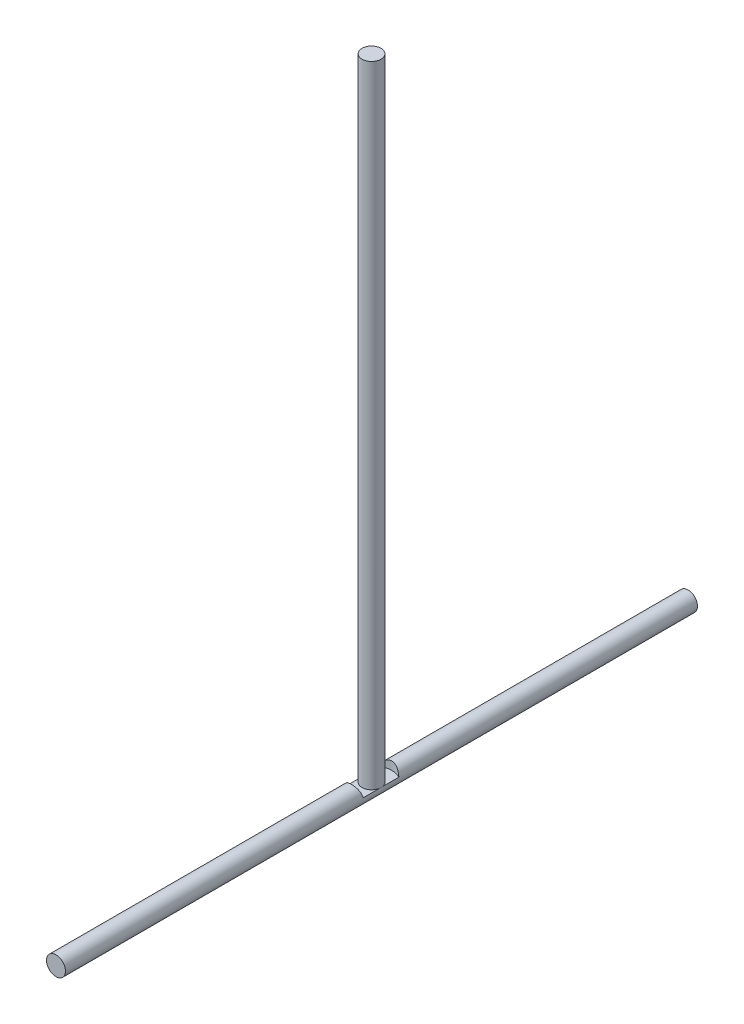
ISO-10303-21;
HEADER;
FILE_DESCRIPTION(('STEP AP214'),'2;1');
FILE_NAME('part.step','',(''),(''),'','','');
FILE_SCHEMA(('AUTOMOTIVE_DESIGN { 1 0 10303 214 1 1 1 1 }'));
ENDSEC;
DATA;
#1=APPLICATION_CONTEXT('core data for automotive mechanical design processes');
#2=APPLICATION_PROTOCOL_DEFINITION('international standard','automotive_design',2000,#1);
#3=PRODUCT_CONTEXT('',#1,'mechanical');
#4=PRODUCT('Part','Part','',(#3));
#5=PRODUCT_RELATED_PRODUCT_CATEGORY('part','',(#4));
#6=PRODUCT_DEFINITION_FORMATION('','',#4);
#7=PRODUCT_DEFINITION_CONTEXT('part definition',#1,'design');
#8=PRODUCT_DEFINITION('design','',#6,#7);
#9=PRODUCT_DEFINITION_SHAPE('','',#8);
#10=(LENGTH_UNIT() NAMED_UNIT(*) SI_UNIT(.MILLI.,.METRE.));
#11=(NAMED_UNIT(*) PLANE_ANGLE_UNIT() SI_UNIT($,.RADIAN.));
#12=(NAMED_UNIT(*) SI_UNIT($,.STERADIAN.) SOLID_ANGLE_UNIT());
#13=UNCERTAINTY_MEASURE_WITH_UNIT(LENGTH_MEASURE(1.E-05),#10,'distance_accuracy_value','');
#14=(GEOMETRIC_REPRESENTATION_CONTEXT(3) GLOBAL_UNCERTAINTY_ASSIGNED_CONTEXT((#13)) GLOBAL_UNIT_ASSIGNED_CONTEXT((#10,
#11,#12)) REPRESENTATION_CONTEXT('',''));
#15=CARTESIAN_POINT('',(0.,0.,0.));
#16=DIRECTION('',(0.,0.,1.));
#17=DIRECTION('',(1.,0.,0.));
#18=AXIS2_PLACEMENT_3D('',#15,#16,#17);
#19=CARTESIAN_POINT('',(0.,1.,250.362407271813));
#20=DIRECTION('',(0.,1.,0.));
#21=DIRECTION('',(0.,0.,1.));
#22=AXIS2_PLACEMENT_3D('',#19,#20,#21);
#23=PLANE('',#22);
#24=DIRECTION('',(0.,0.,-1.));
#25=VECTOR('',#24,1.);
#26=CARTESIAN_POINT('',(-7.43303437365925,1.,500.));
#27=LINE('',#26,#25);
#28=CARTESIAN_POINT('',(-7.43303437365925,1.,236.193779956508));
#29=VERTEX_POINT('',#28);
#30=CARTESIAN_POINT('',(-7.43303437365925,1.,249.362407271813));
#31=VERTEX_POINT('',#30);
#32=EDGE_CURVE('E115',#29,#31,#27,.F.);
#33=ORIENTED_EDGE('',*,*,#32,.T.);
#34=CARTESIAN_POINT('',(0.,1.,250.362407271813));
#35=DIRECTION('',(0.,1.,0.));
#36=DIRECTION('',(0.,0.,1.));
#37=AXIS2_PLACEMENT_3D('',#34,#35,#36);
#38=CIRCLE('',#37,7.5);
#39=CARTESIAN_POINT('',(7.43303437365925,1.,249.362407271813));
#40=VERTEX_POINT('',#39);
#41=EDGE_CURVE('E11',#31,#40,#38,.F.);
#42=ORIENTED_EDGE('',*,*,#41,.T.);
#43=DIRECTION('',(0.,0.,-1.));
#44=VECTOR('',#43,1.);
#45=CARTESIAN_POINT('',(7.43303437365925,1.,500.));
#46=LINE('',#45,#44);
#47=CARTESIAN_POINT('',(7.43303437365925,1.,236.193779956508));
#48=VERTEX_POINT('',#47);
#49=EDGE_CURVE('E102',#40,#48,#46,.T.);
#50=ORIENTED_EDGE('',*,*,#49,.T.);
#51=CARTESIAN_POINT('',(0.,1.,250.362407271813));
#52=DIRECTION('',(0.,1.,0.));
#53=DIRECTION('',(0.,0.,1.));
#54=AXIS2_PLACEMENT_3D('',#51,#52,#53);
#55=CIRCLE('',#54,16.);
#56=EDGE_CURVE('E64',#48,#29,#55,.T.);
#57=ORIENTED_EDGE('',*,*,#56,.T.);
#58=EDGE_LOOP('',(#33,#42,#50,#57));
#59=FACE_BOUND('',#58,.T.);
#60=ADVANCED_FACE('F39',(#59),#23,.T.);
#61=CARTESIAN_POINT('',(0.,0.,500.));
#62=DIRECTION('',(0.,0.,-1.));
#63=DIRECTION('',(-1.,0.,0.));
#64=AXIS2_PLACEMENT_3D('',#61,#62,#63);
#65=CYLINDRICAL_SURFACE('',#64,7.5);
#66=CARTESIAN_POINT('',(0.,0.,0.));
#67=DIRECTION('',(0.,0.,1.));
#68=DIRECTION('',(1.,0.,0.));
#69=AXIS2_PLACEMENT_3D('',#66,#67,#68);
#70=CIRCLE('',#69,7.5);
#71=CARTESIAN_POINT('',(7.5,0.,0.));
#72=VERTEX_POINT('',#71);
#73=EDGE_CURVE('E162',#72,#72,#70,.T.);
#74=ORIENTED_EDGE('',*,*,#73,.T.);
#75=EDGE_LOOP('',(#74));
#76=FACE_BOUND('',#75,.T.);
#77=CARTESIAN_POINT('',(0.,0.,500.));
#78=DIRECTION('',(0.,0.,1.));
#79=DIRECTION('',(1.,0.,0.));
#80=AXIS2_PLACEMENT_3D('',#77,#78,#79);
#81=CIRCLE('',#80,7.5);
#82=CARTESIAN_POINT('',(7.5,0.,500.));
#83=VERTEX_POINT('',#82);
#84=EDGE_CURVE('E171',#83,#83,#81,.T.);
#85=ORIENTED_EDGE('',*,*,#84,.F.);
#86=EDGE_LOOP('',(#85));
#87=FACE_BOUND('',#86,.T.);
#88=CARTESIAN_POINT('',(7.43303437365925,1.,264.531034587117));
#89=VERTEX_POINT('',#88);
#90=CARTESIAN_POINT('',(7.43303437365925,1.,251.362407271813));
#91=VERTEX_POINT('',#90);
#92=EDGE_CURVE('E89',#89,#91,#46,.T.);
#93=ORIENTED_EDGE('',*,*,#92,.F.);
#94=CARTESIAN_POINT('',(7.43303437365925,1.,264.531034587117));
#95=CARTESIAN_POINT('',(7.40559673448088,1.20417418058325,264.545398264692));
#96=CARTESIAN_POINT('',(7.36973608887161,1.40685261559802,264.564140044357));
#97=CARTESIAN_POINT('',(7.2817882143433,1.80762024865179,264.609450136758));
#98=CARTESIAN_POINT('',(7.22971259440707,2.00571262138113,264.636012849421));
#99=CARTESIAN_POINT('',(7.11017935329695,2.39513949711642,264.695924926851));
#100=CARTESIAN_POINT('',(7.04279107679191,2.58650010688598,264.729243625492));
#101=CARTESIAN_POINT('',(6.89318915584988,2.96223442949698,264.801619848646));
#102=CARTESIAN_POINT('',(6.81097309071827,3.14660699555653,264.840678310006));
#103=CARTESIAN_POINT('',(6.63268186261012,3.5068238309024,264.923215792449));
#104=CARTESIAN_POINT('',(6.53664520580528,3.68269003886055,264.966682435494));
#105=CARTESIAN_POINT('',(6.33121503063991,4.02562838614904,265.056906364696));
#106=CARTESIAN_POINT('',(6.22181689771652,4.1926974586012,265.103664785337));
#107=CARTESIAN_POINT('',(5.99023954778523,4.51739309350605,265.199278120021));
#108=CARTESIAN_POINT('',(5.86804580225103,4.67500859576214,265.248135379219));
#109=CARTESIAN_POINT('',(5.61164327741791,4.97987300032481,265.346676463291));
#110=CARTESIAN_POINT('',(5.47743389543021,5.12712138196753,265.396360329524));
#111=CARTESIAN_POINT('',(5.18747097803945,5.4208648526506,265.498968291706));
#112=CARTESIAN_POINT('',(5.03086034194655,5.56652499055838,265.551865010478));
#113=CARTESIAN_POINT('',(4.70546877551462,5.8441671585393,265.655795452156));
#114=CARTESIAN_POINT('',(4.53669189727199,5.97615370737801,265.706829786897));
#115=CARTESIAN_POINT('',(4.18778684133698,6.22562775054615,265.805700989929));
#116=CARTESIAN_POINT('',(4.00765606855613,6.34311191186982,265.85353712204));
#117=CARTESIAN_POINT('',(3.63719104045161,6.56255787678823,265.944679435119));
#118=CARTESIAN_POINT('',(3.44686157611634,6.66452688390385,265.987987715378));
#119=CARTESIAN_POINT('',(3.0581548935784,6.85156582493414,266.068675831004));
#120=CARTESIAN_POINT('',(2.85982623033871,6.93672333143343,266.106086172013));
#121=CARTESIAN_POINT('',(2.45553374241883,7.0899280280309,266.174186669028));
#122=CARTESIAN_POINT('',(2.24956986270232,7.15797509476575,266.204876776582));
#123=CARTESIAN_POINT('',(1.83170740602701,7.2761225865865,266.258607806546));
#124=CARTESIAN_POINT('',(1.61981241727731,7.32623362000128,266.281653249827));
#125=CARTESIAN_POINT('',(1.19175226759904,7.40791392999818,266.319407999242));
#126=CARTESIAN_POINT('',(0.975587518167709,7.43948498444149,266.334118104674));
#127=CARTESIAN_POINT('',(0.560187267692671,7.4817002365052,266.353827760953));
#128=CARTESIAN_POINT('',(0.361148649765772,7.49395067183162,266.359572169894));
#129=CARTESIAN_POINT('',(-0.037340981800173,7.50255387406296,266.363604028593));
#130=CARTESIAN_POINT('',(-0.236791967976834,7.49890766757962,266.361891959894));
#131=CARTESIAN_POINT('',(-0.63453469420906,7.47576394312421,266.351057725533));
#132=CARTESIAN_POINT('',(-0.832826606647137,7.45626884596746,266.341936691543));
#133=CARTESIAN_POINT('',(-1.22677912929279,7.40165914593289,266.316528194825));
#134=CARTESIAN_POINT('',(-1.42243974349858,7.36654456679134,266.300240742986));
#135=CARTESIAN_POINT('',(-1.80236053974454,7.28271204525071,266.261670353457));
#136=CARTESIAN_POINT('',(-1.98677170606741,7.23456031408497,266.23963813119));
#137=CARTESIAN_POINT('',(-2.35075005807958,7.12461462576768,266.189843339477));
#138=CARTESIAN_POINT('',(-2.5303155336438,7.06281592124139,266.162078776139));
#139=CARTESIAN_POINT('',(-2.88345717122264,6.92614633868396,266.101459031702));
#140=CARTESIAN_POINT('',(-3.05703495862207,6.85127904216003,266.068605245603));
#141=CARTESIAN_POINT('',(-3.39736772912442,6.68905647719654,265.998523922061));
#142=CARTESIAN_POINT('',(-3.56412002979821,6.60169635852717,265.961294686892));
#143=CARTESIAN_POINT('',(-4.07185492497294,6.31091784111983,265.839659948998));
#144=CARTESIAN_POINT('',(-4.39971926213581,6.08673239748071,265.748950720315));
#145=CARTESIAN_POINT('',(-5.01492419083785,5.5907882725459,265.559592980336));
#146=CARTESIAN_POINT('',(-5.30222984025028,5.31898901724999,265.460937736911));
#147=CARTESIAN_POINT('',(-5.70989054868075,4.86754889162709,265.309669416866));
#148=CARTESIAN_POINT('',(-5.84656197054068,4.70251833327462,265.256608302076));
#149=CARTESIAN_POINT('',(-6.10552092951541,4.36101929707532,265.152338608338));
#150=CARTESIAN_POINT('',(-6.22781362185403,4.18455495401058,265.101129370021));
#151=CARTESIAN_POINT('',(-6.45707606461018,3.82129126365535,265.002139415278));
#152=CARTESIAN_POINT('',(-6.56406080508475,3.63450227861151,264.954355367997));
#153=CARTESIAN_POINT('',(-6.76194010379948,3.25154882619019,264.863717841138));
#154=CARTESIAN_POINT('',(-6.85284418051575,3.055389992947,264.820861450072));
#155=CARTESIAN_POINT('',(-6.99587989443199,2.70795334361771,264.752062738115));
#156=CARTESIAN_POINT('',(-7.05190274760897,2.55855568944343,264.724647619427));
#157=CARTESIAN_POINT('',(-7.15446894370957,2.25590205484696,264.673830857748));
#158=CARTESIAN_POINT('',(-7.20101469003872,2.10264706375525,264.650428197431));
#159=CARTESIAN_POINT('',(-7.28438666142439,1.79262541861565,264.60810583356));
#160=CARTESIAN_POINT('',(-7.32119665703979,1.63585336762304,264.589193620857));
#161=CARTESIAN_POINT('',(-7.38474636614163,1.31969055119929,264.556304231531));
#162=CARTESIAN_POINT('',(-7.41148096856606,1.16029849935951,264.542329559856));
#163=CARTESIAN_POINT('',(-7.43303437365925,0.999999999999995,264.531034587117));
#164=B_SPLINE_CURVE_WITH_KNOTS('',3,(#94,#95,#96,#97,#98,#99,#100,#101,#102,#103,#104,#105,#106,
#107,#108,#109,#110,#111,#112,#113,#114,#115,#116,#117,#118,#119,#120,#121,#122,#123,#124,#125,
#126,#127,#128,#129,#130,#131,#132,#133,#134,#135,#136,#137,#138,#139,#140,#141,#142,#143,#144,
#145,#146,#147,#148,#149,#150,#151,#152,#153,#154,#155,#156,#157,#158,#159,#160,#161,#162,#163),
.UNSPECIFIED.,.F.,.F.,(4,2,2,2,2,2,2,2,2,2,2,2,2,2,2,2,2,2,2,2,2,2,2,2,2,2,2,2,2,2,2,2,2,2,4),
(0.,0.619228450801778,1.23801458529939,1.85405245074872,2.47019097798087,3.08464494574197,
3.69931172659525,4.3146841457963,4.93008744859262,5.59028430705881,6.25026228694603,
6.9103916647369,7.57021361006475,8.22650212065602,8.88279536283879,9.53869979417922,
10.1945413183538,10.79227743478,11.3899749497303,11.9875811874079,12.5851865169311,
13.1601350787503,13.7352839639703,14.3102754737765,14.8854908281851,16.1022878004257,
17.3201267525475,17.9817119851248,18.6430592907127,19.3037544846703,19.9640572813126,
20.4493979724513,20.9346154268902,21.4206367095477,21.9069042110689),.UNSPECIFIED.);
#165=CARTESIAN_POINT('',(-7.43303437365925,1.,264.531034587117));
#166=VERTEX_POINT('',#165);
#167=EDGE_CURVE('E111',#89,#166,#164,.T.);
#168=ORIENTED_EDGE('',*,*,#167,.T.);
#169=CARTESIAN_POINT('',(-7.43303437365925,1.,251.362407271813));
#170=VERTEX_POINT('',#169);
#171=EDGE_CURVE('E167',#170,#166,#27,.F.);
#172=ORIENTED_EDGE('',*,*,#171,.F.);
#173=EDGE_CURVE('E165',#31,#170,#27,.F.);
#174=ORIENTED_EDGE('',*,*,#173,.F.);
#175=ORIENTED_EDGE('',*,*,#32,.F.);
#176=CARTESIAN_POINT('',(-7.43303437365925,1.,236.193779956508));
#177=CARTESIAN_POINT('',(-7.40559673448088,1.20417418058325,236.179416278934));
#178=CARTESIAN_POINT('',(-7.36973608887161,1.40685261559803,236.160674499269));
#179=CARTESIAN_POINT('',(-7.2817882143433,1.8076202486518,236.115364406867));
#180=CARTESIAN_POINT('',(-7.22971259440707,2.00571262138114,236.088801694204));
#181=CARTESIAN_POINT('',(-7.11017935329695,2.39513949711643,236.028889616774));
#182=CARTESIAN_POINT('',(-7.04279107679191,2.58650010688599,235.995570918134));
#183=CARTESIAN_POINT('',(-6.89318915584987,2.96223442949699,235.923194694979));
#184=CARTESIAN_POINT('',(-6.81097309071827,3.14660699555654,235.88413623362));
#185=CARTESIAN_POINT('',(-6.63268186261012,3.50682383090241,235.801598751176));
#186=CARTESIAN_POINT('',(-6.53664520580528,3.68269003886055,235.758132108132));
#187=CARTESIAN_POINT('',(-6.33121503063991,4.02562838614904,235.66790817893));
#188=CARTESIAN_POINT('',(-6.22181689771652,4.19269745860119,235.621149758289));
#189=CARTESIAN_POINT('',(-5.99023954778524,4.51739309350604,235.525536423604));
#190=CARTESIAN_POINT('',(-5.86804580225104,4.67500859576213,235.476679164406));
#191=CARTESIAN_POINT('',(-5.61164327741791,4.9798730003248,235.378138080335));
#192=CARTESIAN_POINT('',(-5.47743389543021,5.12712138196753,235.328454214101));
#193=CARTESIAN_POINT('',(-5.18747097803945,5.4208648526506,235.225846251919));
#194=CARTESIAN_POINT('',(-5.03086034194655,5.56652499055838,235.172949533147));
#195=CARTESIAN_POINT('',(-4.70546877551462,5.8441671585393,235.069019091469));
#196=CARTESIAN_POINT('',(-4.53669189727199,5.97615370737801,235.017984756728));
#197=CARTESIAN_POINT('',(-4.18778684133698,6.22562775054615,234.919113553697));
#198=CARTESIAN_POINT('',(-4.00765606855613,6.34311191186982,234.871277421585));
#199=CARTESIAN_POINT('',(-3.63719104045161,6.56255787678823,234.780135108507));
#200=CARTESIAN_POINT('',(-3.44686157611634,6.66452688390385,234.736826828247));
#201=CARTESIAN_POINT('',(-3.05815489357839,6.85156582493414,234.656138712622));
#202=CARTESIAN_POINT('',(-2.85982623033871,6.93672333143343,234.618728371612));
#203=CARTESIAN_POINT('',(-2.45553374241883,7.0899280280309,234.550627874597));
#204=CARTESIAN_POINT('',(-2.24956986270232,7.15797509476575,234.519937767044));
#205=CARTESIAN_POINT('',(-1.83170740602701,7.2761225865865,234.46620673708));
#206=CARTESIAN_POINT('',(-1.61981241727731,7.32623362000128,234.443161293798));
#207=CARTESIAN_POINT('',(-1.19175226759903,7.40791392999818,234.405406544384));
#208=CARTESIAN_POINT('',(-0.9755875181677,7.43948498444149,234.390696438952));
#209=CARTESIAN_POINT('',(-0.560187267692663,7.48170023650519,234.370986782673));
#210=CARTESIAN_POINT('',(-0.361148649765763,7.49395067183162,234.365242373731));
#211=CARTESIAN_POINT('',(0.0373409818001826,7.50255387406296,234.361210515032));
#212=CARTESIAN_POINT('',(0.236791967976844,7.49890766757962,234.362922583732));
#213=CARTESIAN_POINT('',(0.634534694209068,7.47576394312421,234.373756818093));
#214=CARTESIAN_POINT('',(0.832826606647142,7.45626884596746,234.382877852082));
#215=CARTESIAN_POINT('',(1.2267791292928,7.40165914593288,234.408286348801));
#216=CARTESIAN_POINT('',(1.42243974349859,7.36654456679133,234.424573800639));
#217=CARTESIAN_POINT('',(1.80236053974455,7.2827120452507,234.463144190169));
#218=CARTESIAN_POINT('',(1.98677170606743,7.23456031408496,234.485176412435));
#219=CARTESIAN_POINT('',(2.3507500580796,7.12461462576767,234.534971204149));
#220=CARTESIAN_POINT('',(2.53031553364382,7.06281592124139,234.562735767486));
#221=CARTESIAN_POINT('',(2.88345717122265,6.92614633868395,234.623355511924));
#222=CARTESIAN_POINT('',(3.05703495862208,6.85127904216003,234.656209298022));
#223=CARTESIAN_POINT('',(3.39736772912443,6.68905647719653,234.726290621564));
#224=CARTESIAN_POINT('',(3.56412002979822,6.60169635852717,234.763519856734));
#225=CARTESIAN_POINT('',(4.07185492497294,6.31091784111983,234.885154594627));
#226=CARTESIAN_POINT('',(4.39971926213581,6.08673239748071,234.97586382331));
#227=CARTESIAN_POINT('',(5.01492419083785,5.59078827254589,235.165221563289));
#228=CARTESIAN_POINT('',(5.30222984025028,5.31898901724999,235.263876806714));
#229=CARTESIAN_POINT('',(5.70989054868075,4.86754889162709,235.415145126759));
#230=CARTESIAN_POINT('',(5.84656197054068,4.70251833327463,235.468206241549));
#231=CARTESIAN_POINT('',(6.1055209295154,4.36101929707533,235.572475935288));
#232=CARTESIAN_POINT('',(6.22781362185403,4.18455495401058,235.623685173604));
#233=CARTESIAN_POINT('',(6.45707606461018,3.82129126365535,235.722675128348));
#234=CARTESIAN_POINT('',(6.56406080508475,3.63450227861151,235.770459175628));
#235=CARTESIAN_POINT('',(6.76194010379948,3.25154882619019,235.861096702488));
#236=CARTESIAN_POINT('',(6.85284418051575,3.055389992947,235.903953093554));
#237=CARTESIAN_POINT('',(6.99587989443199,2.70795334361771,235.972751805511));
#238=CARTESIAN_POINT('',(7.05190274760897,2.55855568944343,236.000166924199));
#239=CARTESIAN_POINT('',(7.15446894370958,2.25590205484695,236.050983685877));
#240=CARTESIAN_POINT('',(7.20101469003872,2.10264706375525,236.074386346195));
#241=CARTESIAN_POINT('',(7.28438666142439,1.79262541861565,236.116708710065));
#242=CARTESIAN_POINT('',(7.32119665703979,1.63585336762304,236.135620922768));
#243=CARTESIAN_POINT('',(7.38474636614162,1.31969055119929,236.168510312094));
#244=CARTESIAN_POINT('',(7.41148096856606,1.16029849935951,236.182484983769));
#245=CARTESIAN_POINT('',(7.43303437365925,1.,236.193779956508));
#246=B_SPLINE_CURVE_WITH_KNOTS('',3,(#176,#177,#178,#179,#180,#181,#182,#183,#184,#185,#186,
#187,#188,#189,#190,#191,#192,#193,#194,#195,#196,#197,#198,#199,#200,#201,#202,#203,#204,#205,
#206,#207,#208,#209,#210,#211,#212,#213,#214,#215,#216,#217,#218,#219,#220,#221,#222,#223,#224,
#225,#226,#227,#228,#229,#230,#231,#232,#233,#234,#235,#236,#237,#238,#239,#240,#241,#242,#243,
#244,#245),.UNSPECIFIED.,.F.,.F.,(4,2,2,2,2,2,2,2,2,2,2,2,2,2,2,2,2,2,2,2,2,2,2,2,2,2,2,2,2,2,2,
2,2,2,4),(0.,0.619228450801781,1.2380145852994,1.85405245074873,2.47019097798088,
3.08464494574198,3.69931172659525,4.31468414579629,4.93008744859262,5.59028430705881,
6.25026228694603,6.9103916647369,7.57021361006475,8.22650212065602,8.88279536283879,
9.53869979417923,10.1945413183538,10.79227743478,11.3899749497303,11.9875811874079,
12.5851865169311,13.1601350787504,13.7352839639703,14.3102754737765,14.8854908281851,
16.1022878004257,17.3201267525475,17.9817119851248,18.6430592907127,19.3037544846703,
19.9640572813127,20.4493979724513,20.9346154268902,21.4206367095477,21.9069042110689),.UNSPECIFIED.);
#247=EDGE_CURVE('E113',#29,#48,#246,.T.);
#248=ORIENTED_EDGE('',*,*,#247,.T.);
#249=ORIENTED_EDGE('',*,*,#49,.F.);
#250=EDGE_CURVE('E93',#91,#40,#46,.T.);
#251=ORIENTED_EDGE('',*,*,#250,.F.);
#252=EDGE_LOOP('',(#93,#168,#172,#174,#175,#248,#249,#251));
#253=FACE_BOUND('',#252,.T.);
#254=ADVANCED_FACE('F41',(#76,#87,#253),#65,.T.);
#255=CARTESIAN_POINT('',(0.,0.,500.));
#256=DIRECTION('',(0.,0.,1.));
#257=DIRECTION('',(1.,0.,0.));
#258=AXIS2_PLACEMENT_3D('',#255,#256,#257);
#259=PLANE('',#258);
#260=ORIENTED_EDGE('',*,*,#84,.T.);
#261=EDGE_LOOP('',(#260));
#262=FACE_BOUND('',#261,.T.);
#263=ADVANCED_FACE('F136',(#262),#259,.T.);
#264=CARTESIAN_POINT('',(0.,0.,0.));
#265=DIRECTION('',(0.,0.,1.));
#266=DIRECTION('',(1.,0.,0.));
#267=AXIS2_PLACEMENT_3D('',#264,#265,#266);
#268=PLANE('',#267);
#269=ORIENTED_EDGE('',*,*,#73,.F.);
#270=EDGE_LOOP('',(#269));
#271=FACE_BOUND('',#270,.T.);
#272=ADVANCED_FACE('F133',(#271),#268,.F.);
#273=CARTESIAN_POINT('',(0.,1.,250.362407271813));
#274=DIRECTION('',(0.,1.,0.));
#275=DIRECTION('',(0.,0.,1.));
#276=AXIS2_PLACEMENT_3D('',#273,#274,#275);
#277=CYLINDRICAL_SURFACE('',#276,16.);
#278=EDGE_CURVE('E107',#166,#89,#55,.T.);
#279=ORIENTED_EDGE('',*,*,#278,.F.);
#280=ORIENTED_EDGE('',*,*,#167,.F.);
#281=EDGE_LOOP('',(#279,#280));
#282=FACE_BOUND('',#281,.T.);
#283=ADVANCED_FACE('F127',(#282),#277,.F.);
#284=ORIENTED_EDGE('',*,*,#56,.F.);
#285=ORIENTED_EDGE('',*,*,#247,.F.);
#286=EDGE_LOOP('',(#284,#285));
#287=FACE_BOUND('',#286,.T.);
#288=ADVANCED_FACE('F132',(#287),#277,.F.);
#289=ORIENTED_EDGE('',*,*,#92,.T.);
#290=EDGE_CURVE('E44',#91,#170,#38,.F.);
#291=ORIENTED_EDGE('',*,*,#290,.T.);
#292=ORIENTED_EDGE('',*,*,#171,.T.);
#293=ORIENTED_EDGE('',*,*,#278,.T.);
#294=EDGE_LOOP('',(#289,#291,#292,#293));
#295=FACE_BOUND('',#294,.T.);
#296=ADVANCED_FACE('F105',(#295),#23,.T.);
#297=CARTESIAN_POINT('',(0.,1.,250.362407271813));
#298=DIRECTION('',(0.,1.,0.));
#299=DIRECTION('',(0.,0.,1.));
#300=AXIS2_PLACEMENT_3D('',#297,#298,#299);
#301=PLANE('',#300);
#302=CARTESIAN_POINT('',(0.,1.,250.362407271813));
#303=DIRECTION('',(0.,1.,0.));
#304=DIRECTION('',(0.,0.,1.));
#305=AXIS2_PLACEMENT_3D('',#302,#303,#304);
#306=CIRCLE('',#305,7.5);
#307=EDGE_CURVE('E84',#91,#40,#306,.T.);
#308=ORIENTED_EDGE('',*,*,#307,.F.);
#309=ORIENTED_EDGE('',*,*,#250,.T.);
#310=EDGE_LOOP('',(#308,#309));
#311=FACE_BOUND('',#310,.T.);
#312=ADVANCED_FACE('F92',(#311),#301,.F.);
#313=EDGE_CURVE('E56',#31,#170,#306,.T.);
#314=ORIENTED_EDGE('',*,*,#313,.F.);
#315=ORIENTED_EDGE('',*,*,#173,.T.);
#316=EDGE_LOOP('',(#314,#315));
#317=FACE_BOUND('',#316,.T.);
#318=ADVANCED_FACE('F155',(#317),#301,.F.);
#319=CARTESIAN_POINT('',(0.,500.,250.362407271813));
#320=DIRECTION('',(0.,-1.,0.));
#321=DIRECTION('',(0.,0.,-1.));
#322=AXIS2_PLACEMENT_3D('',#319,#320,#321);
#323=CYLINDRICAL_SURFACE('',#322,7.5);
#324=CARTESIAN_POINT('',(0.,500.,250.362407271813));
#325=DIRECTION('',(0.,1.,0.));
#326=DIRECTION('',(0.,0.,1.));
#327=AXIS2_PLACEMENT_3D('',#324,#325,#326);
#328=CIRCLE('',#327,7.5);
#329=CARTESIAN_POINT('',(0.,500.,257.862407271813));
#330=VERTEX_POINT('',#329);
#331=EDGE_CURVE('E95',#330,#330,#328,.T.);
#332=ORIENTED_EDGE('',*,*,#331,.F.);
#333=EDGE_LOOP('',(#332));
#334=FACE_BOUND('',#333,.T.);
#335=ORIENTED_EDGE('',*,*,#307,.T.);
#336=ORIENTED_EDGE('',*,*,#41,.F.);
#337=ORIENTED_EDGE('',*,*,#313,.T.);
#338=ORIENTED_EDGE('',*,*,#290,.F.);
#339=EDGE_LOOP('',(#335,#336,#337,#338));
#340=FACE_BOUND('',#339,.T.);
#341=ADVANCED_FACE('F83',(#334,#340),#323,.T.);
#342=CARTESIAN_POINT('',(0.,500.,250.362407271813));
#343=DIRECTION('',(0.,1.,0.));
#344=DIRECTION('',(0.,0.,1.));
#345=AXIS2_PLACEMENT_3D('',#342,#343,#344);
#346=PLANE('',#345);
#347=ORIENTED_EDGE('',*,*,#331,.T.);
#348=EDGE_LOOP('',(#347));
#349=FACE_BOUND('',#348,.T.);
#350=ADVANCED_FACE('F184',(#349),#346,.T.);
#351=CLOSED_SHELL('',(#60,#254,#263,#272,#283,#288,#296,#312,#318,#341,#350));
#352=MANIFOLD_SOLID_BREP('B2',#351);
#353=ADVANCED_BREP_SHAPE_REPRESENTATION('',(#18,#352),#14);
#354=SHAPE_DEFINITION_REPRESENTATION(#9,#353);
ENDSEC;
END-ISO-10303-21;
